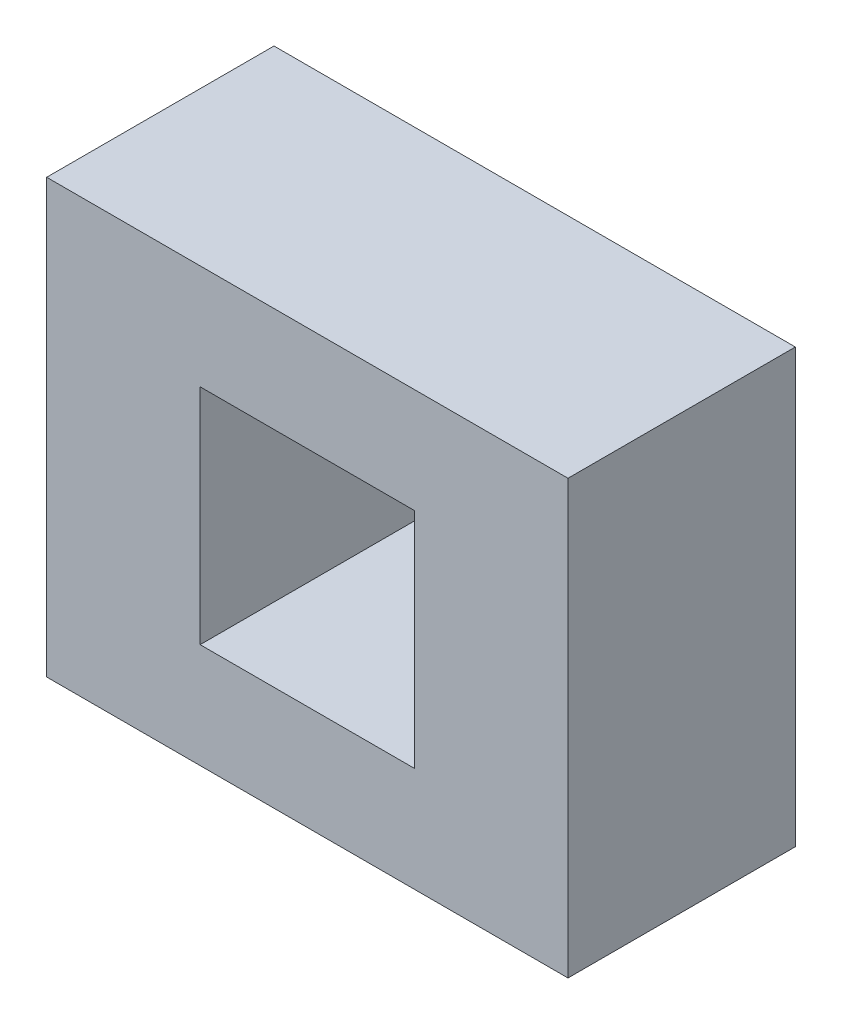
ISO-10303-21;
HEADER;
FILE_DESCRIPTION(('STEP AP214'),'2;1');
FILE_NAME('part.step','',(''),(''),'','','');
FILE_SCHEMA(('AUTOMOTIVE_DESIGN { 1 0 10303 214 1 1 1 1 }'));
ENDSEC;
DATA;
#1=APPLICATION_CONTEXT('core data for automotive mechanical design processes');
#2=APPLICATION_PROTOCOL_DEFINITION('international standard','automotive_design',2000,#1);
#3=PRODUCT_CONTEXT('',#1,'mechanical');
#4=PRODUCT('Part','Part','',(#3));
#5=PRODUCT_RELATED_PRODUCT_CATEGORY('part','',(#4));
#6=PRODUCT_DEFINITION_FORMATION('','',#4);
#7=PRODUCT_DEFINITION_CONTEXT('part definition',#1,'design');
#8=PRODUCT_DEFINITION('design','',#6,#7);
#9=PRODUCT_DEFINITION_SHAPE('','',#8);
#10=(LENGTH_UNIT() NAMED_UNIT(*) SI_UNIT(.MILLI.,.METRE.));
#11=(NAMED_UNIT(*) PLANE_ANGLE_UNIT() SI_UNIT($,.RADIAN.));
#12=(NAMED_UNIT(*) SI_UNIT($,.STERADIAN.) SOLID_ANGLE_UNIT());
#13=UNCERTAINTY_MEASURE_WITH_UNIT(LENGTH_MEASURE(1.E-05),#10,'distance_accuracy_value','');
#14=(GEOMETRIC_REPRESENTATION_CONTEXT(3) GLOBAL_UNCERTAINTY_ASSIGNED_CONTEXT((#13)) GLOBAL_UNIT_ASSIGNED_CONTEXT((#10,
#11,#12)) REPRESENTATION_CONTEXT('',''));
#15=CARTESIAN_POINT('',(0.,0.,0.));
#16=DIRECTION('',(0.,0.,1.));
#17=DIRECTION('',(1.,0.,0.));
#18=AXIS2_PLACEMENT_3D('',#15,#16,#17);
#19=CARTESIAN_POINT('',(0.,0.,50.));
#20=DIRECTION('',(0.,0.,1.));
#21=DIRECTION('',(1.,0.,0.));
#22=AXIS2_PLACEMENT_3D('',#19,#20,#21);
#23=PLANE('',#22);
#24=DIRECTION('',(0.,-1.,0.));
#25=VECTOR('',#24,1.);
#26=CARTESIAN_POINT('',(-57.3303978444858,-47.5967321668395,50.));
#27=LINE('',#26,#25);
#28=CARTESIAN_POINT('',(-57.3303978444858,47.5967321668395,50.));
#29=VERTEX_POINT('',#28);
#30=CARTESIAN_POINT('',(-57.3303978444858,-47.5967321668395,50.));
#31=VERTEX_POINT('',#30);
#32=EDGE_CURVE('E134',#29,#31,#27,.T.);
#33=ORIENTED_EDGE('',*,*,#32,.T.);
#34=DIRECTION('',(1.,0.,0.));
#35=VECTOR('',#34,1.);
#36=CARTESIAN_POINT('',(57.3303978444858,-47.5967321668395,50.));
#37=LINE('',#36,#35);
#38=CARTESIAN_POINT('',(57.3303978444858,-47.5967321668395,50.));
#39=VERTEX_POINT('',#38);
#40=EDGE_CURVE('E137',#31,#39,#37,.T.);
#41=ORIENTED_EDGE('',*,*,#40,.T.);
#42=DIRECTION('',(0.,1.,0.));
#43=VECTOR('',#42,1.);
#44=CARTESIAN_POINT('',(57.3303978444858,-47.5967321668395,50.));
#45=LINE('',#44,#43);
#46=CARTESIAN_POINT('',(57.3303978444858,47.5967321668395,50.));
#47=VERTEX_POINT('',#46);
#48=EDGE_CURVE('E140',#39,#47,#45,.T.);
#49=ORIENTED_EDGE('',*,*,#48,.T.);
#50=DIRECTION('',(-1.,0.,0.));
#51=VECTOR('',#50,1.);
#52=CARTESIAN_POINT('',(57.3303978444858,47.5967321668395,50.));
#53=LINE('',#52,#51);
#54=EDGE_CURVE('E142',#47,#29,#53,.T.);
#55=ORIENTED_EDGE('',*,*,#54,.T.);
#56=EDGE_LOOP('',(#33,#41,#49,#55));
#57=FACE_BOUND('',#56,.T.);
#58=DIRECTION('',(1.,0.,0.));
#59=VECTOR('',#58,1.);
#60=CARTESIAN_POINT('',(23.5751168706297,-24.5574134069059,50.));
#61=LINE('',#60,#59);
#62=CARTESIAN_POINT('',(-23.5751168706297,-24.5574134069059,50.));
#63=VERTEX_POINT('',#62);
#64=CARTESIAN_POINT('',(23.5751168706297,-24.5574134069059,50.));
#65=VERTEX_POINT('',#64);
#66=EDGE_CURVE('E106',#63,#65,#61,.T.);
#67=ORIENTED_EDGE('',*,*,#66,.F.);
#68=DIRECTION('',(0.,-1.,0.));
#69=VECTOR('',#68,1.);
#70=CARTESIAN_POINT('',(-23.5751168706297,-24.5574134069059,50.));
#71=LINE('',#70,#69);
#72=CARTESIAN_POINT('',(-23.5751168706297,24.5574134069059,50.));
#73=VERTEX_POINT('',#72);
#74=EDGE_CURVE('E98',#73,#63,#71,.T.);
#75=ORIENTED_EDGE('',*,*,#74,.F.);
#76=DIRECTION('',(-1.,0.,0.));
#77=VECTOR('',#76,1.);
#78=CARTESIAN_POINT('',(23.5751168706297,24.5574134069059,50.));
#79=LINE('',#78,#77);
#80=CARTESIAN_POINT('',(23.5751168706297,24.5574134069059,50.));
#81=VERTEX_POINT('',#80);
#82=EDGE_CURVE('E120',#81,#73,#79,.T.);
#83=ORIENTED_EDGE('',*,*,#82,.F.);
#84=DIRECTION('',(0.,1.,0.));
#85=VECTOR('',#84,1.);
#86=CARTESIAN_POINT('',(23.5751168706297,-24.5574134069059,50.));
#87=LINE('',#86,#85);
#88=EDGE_CURVE('E118',#65,#81,#87,.T.);
#89=ORIENTED_EDGE('',*,*,#88,.F.);
#90=EDGE_LOOP('',(#67,#75,#83,#89));
#91=FACE_BOUND('',#90,.T.);
#92=ADVANCED_FACE('F33',(#57,#91),#23,.T.);
#93=CARTESIAN_POINT('',(0.,0.,0.));
#94=DIRECTION('',(0.,0.,1.));
#95=DIRECTION('',(1.,0.,0.));
#96=AXIS2_PLACEMENT_3D('',#93,#94,#95);
#97=PLANE('',#96);
#98=DIRECTION('',(0.,-1.,0.));
#99=VECTOR('',#98,1.);
#100=CARTESIAN_POINT('',(-57.3303978444858,-47.5967321668395,0.));
#101=LINE('',#100,#99);
#102=CARTESIAN_POINT('',(-57.3303978444858,47.5967321668395,0.));
#103=VERTEX_POINT('',#102);
#104=CARTESIAN_POINT('',(-57.3303978444858,-47.5967321668395,0.));
#105=VERTEX_POINT('',#104);
#106=EDGE_CURVE('E114',#103,#105,#101,.T.);
#107=ORIENTED_EDGE('',*,*,#106,.F.);
#108=DIRECTION('',(-1.,0.,0.));
#109=VECTOR('',#108,1.);
#110=CARTESIAN_POINT('',(57.3303978444858,47.5967321668395,0.));
#111=LINE('',#110,#109);
#112=CARTESIAN_POINT('',(57.3303978444858,47.5967321668395,0.));
#113=VERTEX_POINT('',#112);
#114=EDGE_CURVE('E138',#113,#103,#111,.T.);
#115=ORIENTED_EDGE('',*,*,#114,.F.);
#116=DIRECTION('',(0.,1.,0.));
#117=VECTOR('',#116,1.);
#118=CARTESIAN_POINT('',(57.3303978444858,-47.5967321668395,0.));
#119=LINE('',#118,#117);
#120=CARTESIAN_POINT('',(57.3303978444858,-47.5967321668395,0.));
#121=VERTEX_POINT('',#120);
#122=EDGE_CURVE('E149',#121,#113,#119,.T.);
#123=ORIENTED_EDGE('',*,*,#122,.F.);
#124=DIRECTION('',(1.,0.,0.));
#125=VECTOR('',#124,1.);
#126=CARTESIAN_POINT('',(57.3303978444858,-47.5967321668395,0.));
#127=LINE('',#126,#125);
#128=EDGE_CURVE('E147',#105,#121,#127,.T.);
#129=ORIENTED_EDGE('',*,*,#128,.F.);
#130=EDGE_LOOP('',(#107,#115,#123,#129));
#131=FACE_BOUND('',#130,.T.);
#132=DIRECTION('',(0.,-1.,0.));
#133=VECTOR('',#132,1.);
#134=CARTESIAN_POINT('',(-23.5751168706297,-24.5574134069059,0.));
#135=LINE('',#134,#133);
#136=CARTESIAN_POINT('',(-23.5751168706297,24.5574134069059,0.));
#137=VERTEX_POINT('',#136);
#138=CARTESIAN_POINT('',(-23.5751168706297,-24.5574134069059,0.));
#139=VERTEX_POINT('',#138);
#140=EDGE_CURVE('E56',#137,#139,#135,.T.);
#141=ORIENTED_EDGE('',*,*,#140,.T.);
#142=DIRECTION('',(1.,0.,0.));
#143=VECTOR('',#142,1.);
#144=CARTESIAN_POINT('',(23.5751168706297,-24.5574134069059,0.));
#145=LINE('',#144,#143);
#146=CARTESIAN_POINT('',(23.5751168706297,-24.5574134069059,0.));
#147=VERTEX_POINT('',#146);
#148=EDGE_CURVE('E113',#139,#147,#145,.T.);
#149=ORIENTED_EDGE('',*,*,#148,.T.);
#150=DIRECTION('',(0.,1.,0.));
#151=VECTOR('',#150,1.);
#152=CARTESIAN_POINT('',(23.5751168706297,-24.5574134069059,0.));
#153=LINE('',#152,#151);
#154=CARTESIAN_POINT('',(23.5751168706297,24.5574134069059,0.));
#155=VERTEX_POINT('',#154);
#156=EDGE_CURVE('E126',#147,#155,#153,.T.);
#157=ORIENTED_EDGE('',*,*,#156,.T.);
#158=DIRECTION('',(-1.,0.,0.));
#159=VECTOR('',#158,1.);
#160=CARTESIAN_POINT('',(23.5751168706297,24.5574134069059,0.));
#161=LINE('',#160,#159);
#162=EDGE_CURVE('E107',#155,#137,#161,.T.);
#163=ORIENTED_EDGE('',*,*,#162,.T.);
#164=EDGE_LOOP('',(#141,#149,#157,#163));
#165=FACE_BOUND('',#164,.T.);
#166=ADVANCED_FACE('F167',(#131,#165),#97,.F.);
#167=CARTESIAN_POINT('',(-57.3303978444858,-47.5967321668395,50.));
#168=DIRECTION('',(1.,0.,0.));
#169=DIRECTION('',(0.,0.,-1.));
#170=AXIS2_PLACEMENT_3D('',#167,#168,#169);
#171=PLANE('',#170);
#172=ORIENTED_EDGE('',*,*,#106,.T.);
#173=DIRECTION('',(0.,0.,-1.));
#174=VECTOR('',#173,1.);
#175=CARTESIAN_POINT('',(-57.3303978444858,-47.5967321668395,50.));
#176=LINE('',#175,#174);
#177=EDGE_CURVE('E11',#31,#105,#176,.T.);
#178=ORIENTED_EDGE('',*,*,#177,.F.);
#179=ORIENTED_EDGE('',*,*,#32,.F.);
#180=DIRECTION('',(0.,0.,-1.));
#181=VECTOR('',#180,1.);
#182=CARTESIAN_POINT('',(-57.3303978444858,47.5967321668395,50.));
#183=LINE('',#182,#181);
#184=EDGE_CURVE('E144',#29,#103,#183,.T.);
#185=ORIENTED_EDGE('',*,*,#184,.T.);
#186=EDGE_LOOP('',(#172,#178,#179,#185));
#187=FACE_BOUND('',#186,.T.);
#188=ADVANCED_FACE('F35',(#187),#171,.F.);
#189=CARTESIAN_POINT('',(57.3303978444858,-47.5967321668395,50.));
#190=DIRECTION('',(0.,1.,0.));
#191=DIRECTION('',(0.,0.,1.));
#192=AXIS2_PLACEMENT_3D('',#189,#190,#191);
#193=PLANE('',#192);
#194=ORIENTED_EDGE('',*,*,#128,.T.);
#195=DIRECTION('',(0.,0.,-1.));
#196=VECTOR('',#195,1.);
#197=CARTESIAN_POINT('',(57.3303978444858,-47.5967321668395,50.));
#198=LINE('',#197,#196);
#199=EDGE_CURVE('E41',#39,#121,#198,.T.);
#200=ORIENTED_EDGE('',*,*,#199,.F.);
#201=ORIENTED_EDGE('',*,*,#40,.F.);
#202=ORIENTED_EDGE('',*,*,#177,.T.);
#203=EDGE_LOOP('',(#194,#200,#201,#202));
#204=FACE_BOUND('',#203,.T.);
#205=ADVANCED_FACE('F177',(#204),#193,.F.);
#206=CARTESIAN_POINT('',(57.3303978444858,-47.5967321668395,50.));
#207=DIRECTION('',(-1.,0.,0.));
#208=DIRECTION('',(0.,0.,1.));
#209=AXIS2_PLACEMENT_3D('',#206,#207,#208);
#210=PLANE('',#209);
#211=ORIENTED_EDGE('',*,*,#122,.T.);
#212=DIRECTION('',(0.,0.,-1.));
#213=VECTOR('',#212,1.);
#214=CARTESIAN_POINT('',(57.3303978444858,47.5967321668395,50.));
#215=LINE('',#214,#213);
#216=EDGE_CURVE('E154',#47,#113,#215,.T.);
#217=ORIENTED_EDGE('',*,*,#216,.F.);
#218=ORIENTED_EDGE('',*,*,#48,.F.);
#219=ORIENTED_EDGE('',*,*,#199,.T.);
#220=EDGE_LOOP('',(#211,#217,#218,#219));
#221=FACE_BOUND('',#220,.T.);
#222=ADVANCED_FACE('F161',(#221),#210,.F.);
#223=CARTESIAN_POINT('',(57.3303978444858,47.5967321668395,50.));
#224=DIRECTION('',(0.,-1.,0.));
#225=DIRECTION('',(0.,0.,-1.));
#226=AXIS2_PLACEMENT_3D('',#223,#224,#225);
#227=PLANE('',#226);
#228=ORIENTED_EDGE('',*,*,#114,.T.);
#229=ORIENTED_EDGE('',*,*,#184,.F.);
#230=ORIENTED_EDGE('',*,*,#54,.F.);
#231=ORIENTED_EDGE('',*,*,#216,.T.);
#232=EDGE_LOOP('',(#228,#229,#230,#231));
#233=FACE_BOUND('',#232,.T.);
#234=ADVANCED_FACE('F171',(#233),#227,.F.);
#235=CARTESIAN_POINT('',(-23.5751168706297,-24.5574134069059,50.));
#236=DIRECTION('',(1.,0.,0.));
#237=DIRECTION('',(0.,0.,-1.));
#238=AXIS2_PLACEMENT_3D('',#235,#236,#237);
#239=PLANE('',#238);
#240=ORIENTED_EDGE('',*,*,#140,.F.);
#241=DIRECTION('',(0.,0.,-1.));
#242=VECTOR('',#241,1.);
#243=CARTESIAN_POINT('',(-23.5751168706297,24.5574134069059,50.));
#244=LINE('',#243,#242);
#245=EDGE_CURVE('E102',#73,#137,#244,.T.);
#246=ORIENTED_EDGE('',*,*,#245,.F.);
#247=ORIENTED_EDGE('',*,*,#74,.T.);
#248=DIRECTION('',(0.,0.,-1.));
#249=VECTOR('',#248,1.);
#250=CARTESIAN_POINT('',(-23.5751168706297,-24.5574134069059,50.));
#251=LINE('',#250,#249);
#252=EDGE_CURVE('E101',#63,#139,#251,.T.);
#253=ORIENTED_EDGE('',*,*,#252,.T.);
#254=EDGE_LOOP('',(#240,#246,#247,#253));
#255=FACE_BOUND('',#254,.T.);
#256=ADVANCED_FACE('F100',(#255),#239,.T.);
#257=CARTESIAN_POINT('',(23.5751168706297,-24.5574134069059,50.));
#258=DIRECTION('',(0.,1.,0.));
#259=DIRECTION('',(0.,0.,1.));
#260=AXIS2_PLACEMENT_3D('',#257,#258,#259);
#261=PLANE('',#260);
#262=ORIENTED_EDGE('',*,*,#148,.F.);
#263=ORIENTED_EDGE('',*,*,#252,.F.);
#264=ORIENTED_EDGE('',*,*,#66,.T.);
#265=DIRECTION('',(0.,0.,-1.));
#266=VECTOR('',#265,1.);
#267=CARTESIAN_POINT('',(23.5751168706297,-24.5574134069059,50.));
#268=LINE('',#267,#266);
#269=EDGE_CURVE('E115',#65,#147,#268,.T.);
#270=ORIENTED_EDGE('',*,*,#269,.T.);
#271=EDGE_LOOP('',(#262,#263,#264,#270));
#272=FACE_BOUND('',#271,.T.);
#273=ADVANCED_FACE('F110',(#272),#261,.T.);
#274=CARTESIAN_POINT('',(23.5751168706297,-24.5574134069059,50.));
#275=DIRECTION('',(-1.,0.,0.));
#276=DIRECTION('',(0.,0.,1.));
#277=AXIS2_PLACEMENT_3D('',#274,#275,#276);
#278=PLANE('',#277);
#279=ORIENTED_EDGE('',*,*,#156,.F.);
#280=ORIENTED_EDGE('',*,*,#269,.F.);
#281=ORIENTED_EDGE('',*,*,#88,.T.);
#282=DIRECTION('',(0.,0.,-1.));
#283=VECTOR('',#282,1.);
#284=CARTESIAN_POINT('',(23.5751168706297,24.5574134069059,50.));
#285=LINE('',#284,#283);
#286=EDGE_CURVE('E48',#81,#155,#285,.T.);
#287=ORIENTED_EDGE('',*,*,#286,.T.);
#288=EDGE_LOOP('',(#279,#280,#281,#287));
#289=FACE_BOUND('',#288,.T.);
#290=ADVANCED_FACE('F200',(#289),#278,.T.);
#291=CARTESIAN_POINT('',(23.5751168706297,24.5574134069059,50.));
#292=DIRECTION('',(0.,-1.,0.));
#293=DIRECTION('',(0.,0.,-1.));
#294=AXIS2_PLACEMENT_3D('',#291,#292,#293);
#295=PLANE('',#294);
#296=ORIENTED_EDGE('',*,*,#162,.F.);
#297=ORIENTED_EDGE('',*,*,#286,.F.);
#298=ORIENTED_EDGE('',*,*,#82,.T.);
#299=ORIENTED_EDGE('',*,*,#245,.T.);
#300=EDGE_LOOP('',(#296,#297,#298,#299));
#301=FACE_BOUND('',#300,.T.);
#302=ADVANCED_FACE('F204',(#301),#295,.T.);
#303=CLOSED_SHELL('',(#92,#166,#188,#205,#222,#234,#256,#273,#290,#302));
#304=MANIFOLD_SOLID_BREP('B2',#303);
#305=ADVANCED_BREP_SHAPE_REPRESENTATION('',(#18,#304),#14);
#306=SHAPE_DEFINITION_REPRESENTATION(#9,#305);
ENDSEC;
END-ISO-10303-21;
